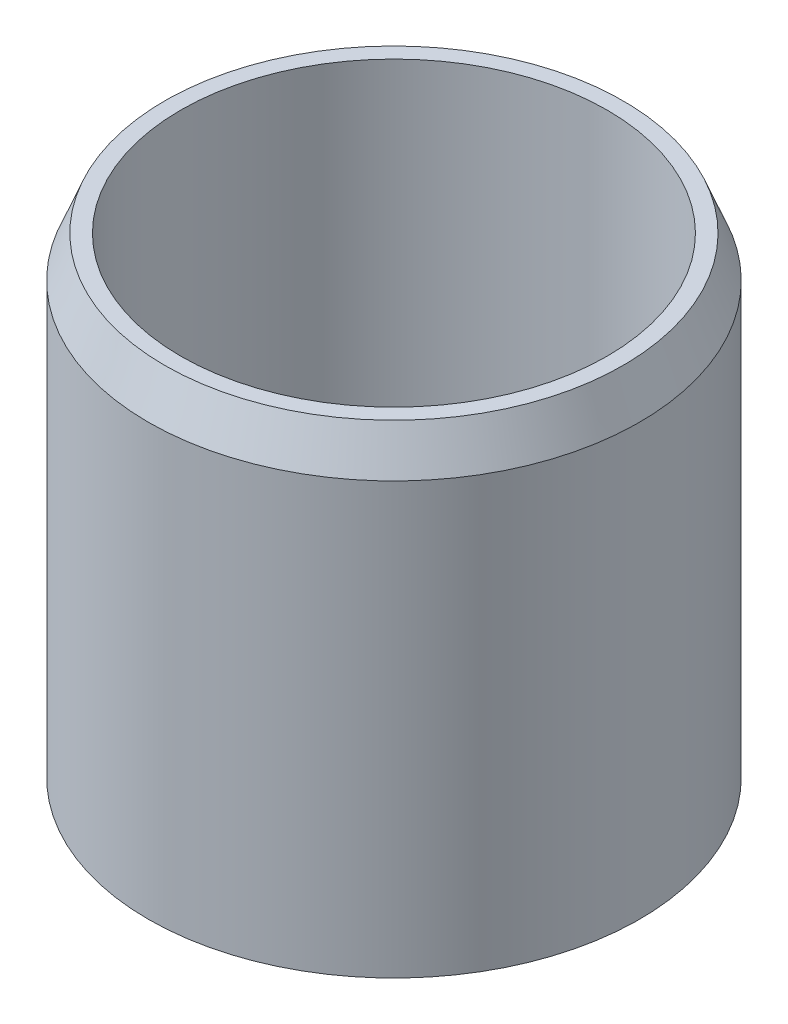
ISO-10303-21;
HEADER;
FILE_DESCRIPTION(('STEP AP214'),'2;1');
FILE_NAME('part.step','',(''),(''),'','','');
FILE_SCHEMA(('AUTOMOTIVE_DESIGN { 1 0 10303 214 1 1 1 1 }'));
ENDSEC;
DATA;
#1=APPLICATION_CONTEXT('core data for automotive mechanical design processes');
#2=APPLICATION_PROTOCOL_DEFINITION('international standard','automotive_design',2000,#1);
#3=PRODUCT_CONTEXT('',#1,'mechanical');
#4=PRODUCT('Part','Part','',(#3));
#5=PRODUCT_RELATED_PRODUCT_CATEGORY('part','',(#4));
#6=PRODUCT_DEFINITION_FORMATION('','',#4);
#7=PRODUCT_DEFINITION_CONTEXT('part definition',#1,'design');
#8=PRODUCT_DEFINITION('design','',#6,#7);
#9=PRODUCT_DEFINITION_SHAPE('','',#8);
#10=(LENGTH_UNIT() NAMED_UNIT(*) SI_UNIT(.MILLI.,.METRE.));
#11=(NAMED_UNIT(*) PLANE_ANGLE_UNIT() SI_UNIT($,.RADIAN.));
#12=(NAMED_UNIT(*) SI_UNIT($,.STERADIAN.) SOLID_ANGLE_UNIT());
#13=UNCERTAINTY_MEASURE_WITH_UNIT(LENGTH_MEASURE(1.E-05),#10,'distance_accuracy_value','');
#14=(GEOMETRIC_REPRESENTATION_CONTEXT(3) GLOBAL_UNCERTAINTY_ASSIGNED_CONTEXT((#13)) GLOBAL_UNIT_ASSIGNED_CONTEXT((#10,
#11,#12)) REPRESENTATION_CONTEXT('',''));
#15=CARTESIAN_POINT('',(0.,0.,0.));
#16=DIRECTION('',(0.,0.,1.));
#17=DIRECTION('',(1.,0.,0.));
#18=AXIS2_PLACEMENT_3D('',#15,#16,#17);
#19=CARTESIAN_POINT('',(0.,9.525,0.));
#20=DIRECTION('',(0.,1.,0.));
#21=DIRECTION('',(0.,0.,1.));
#22=AXIS2_PLACEMENT_3D('',#19,#20,#21);
#23=PLANE('',#22);
#24=CARTESIAN_POINT('',(0.,9.525,0.));
#25=DIRECTION('',(0.,1.,0.));
#26=DIRECTION('',(0.,0.,1.));
#27=AXIS2_PLACEMENT_3D('',#24,#25,#26);
#28=CIRCLE('',#27,12.7);
#29=CARTESIAN_POINT('',(0.,9.525,12.7));
#30=VERTEX_POINT('',#29);
#31=EDGE_CURVE('E104',#30,#30,#28,.T.);
#32=ORIENTED_EDGE('',*,*,#31,.F.);
#33=EDGE_LOOP('',(#32));
#34=FACE_BOUND('',#33,.T.);
#35=CARTESIAN_POINT('',(21.7411519625083,9.525,-7.06412849141284));
#36=DIRECTION('',(0.,1.,0.));
#37=DIRECTION('',(0.,0.,1.));
#38=AXIS2_PLACEMENT_3D('',#35,#36,#37);
#39=CIRCLE('',#38,7.62);
#40=CARTESIAN_POINT('',(21.7411519625083,9.525,0.555871508587157));
#41=VERTEX_POINT('',#40);
#42=EDGE_CURVE('E61',#41,#41,#39,.T.);
#43=ORIENTED_EDGE('',*,*,#42,.F.);
#44=EDGE_LOOP('',(#43));
#45=FACE_BOUND('',#44,.T.);
#46=CARTESIAN_POINT('',(13.4367708674089,9.525,18.4941284914103));
#47=DIRECTION('',(0.,1.,0.));
#48=DIRECTION('',(0.,0.,1.));
#49=AXIS2_PLACEMENT_3D('',#46,#47,#48);
#50=CIRCLE('',#49,7.62);
#51=CARTESIAN_POINT('',(13.4367708674089,9.525,26.1141284914103));
#52=VERTEX_POINT('',#51);
#53=EDGE_CURVE('E87',#52,#52,#50,.T.);
#54=ORIENTED_EDGE('',*,*,#53,.F.);
#55=EDGE_LOOP('',(#54));
#56=FACE_BOUND('',#55,.T.);
#57=CARTESIAN_POINT('',(-13.436770867403,9.525,18.4941284914123));
#58=DIRECTION('',(0.,1.,0.));
#59=DIRECTION('',(0.,0.,1.));
#60=AXIS2_PLACEMENT_3D('',#57,#58,#59);
#61=CIRCLE('',#60,7.62);
#62=CARTESIAN_POINT('',(-13.436770867403,9.525,26.1141284914122));
#63=VERTEX_POINT('',#62);
#64=EDGE_CURVE('E90',#63,#63,#61,.T.);
#65=ORIENTED_EDGE('',*,*,#64,.F.);
#66=EDGE_LOOP('',(#65));
#67=FACE_BOUND('',#66,.T.);
#68=CARTESIAN_POINT('',(-21.7411519625061,9.525,-7.06412849140975));
#69=DIRECTION('',(0.,1.,0.));
#70=DIRECTION('',(0.,0.,1.));
#71=AXIS2_PLACEMENT_3D('',#68,#69,#70);
#72=CIRCLE('',#71,7.62);
#73=CARTESIAN_POINT('',(-21.7411519625061,9.525,0.555871508590244));
#74=VERTEX_POINT('',#73);
#75=EDGE_CURVE('E93',#74,#74,#72,.T.);
#76=ORIENTED_EDGE('',*,*,#75,.F.);
#77=EDGE_LOOP('',(#76));
#78=FACE_BOUND('',#77,.T.);
#79=CARTESIAN_POINT('',(0.,9.525,-22.86));
#80=DIRECTION('',(0.,1.,0.));
#81=DIRECTION('',(0.,0.,1.));
#82=AXIS2_PLACEMENT_3D('',#79,#80,#81);
#83=CIRCLE('',#82,7.62);
#84=CARTESIAN_POINT('',(0.,9.525,-15.24));
#85=VERTEX_POINT('',#84);
#86=EDGE_CURVE('E65',#85,#85,#83,.T.);
#87=ORIENTED_EDGE('',*,*,#86,.F.);
#88=EDGE_LOOP('',(#87));
#89=FACE_BOUND('',#88,.T.);
#90=CARTESIAN_POINT('',(0.,9.525,0.));
#91=DIRECTION('',(0.,1.,0.));
#92=DIRECTION('',(0.,0.,1.));
#93=AXIS2_PLACEMENT_3D('',#90,#91,#92);
#94=CIRCLE('',#93,33.02);
#95=CARTESIAN_POINT('',(0.,9.525,33.02));
#96=VERTEX_POINT('',#95);
#97=EDGE_CURVE('E98',#96,#96,#94,.T.);
#98=ORIENTED_EDGE('',*,*,#97,.T.);
#99=EDGE_LOOP('',(#98));
#100=FACE_BOUND('',#99,.T.);
#101=ADVANCED_FACE('F41',(#34,#45,#56,#67,#78,#89,#100),#23,.T.);
#102=CARTESIAN_POINT('',(0.,9.525,0.));
#103=DIRECTION('',(0.,-1.,0.));
#104=DIRECTION('',(0.,0.,-1.));
#105=AXIS2_PLACEMENT_3D('',#102,#103,#104);
#106=CYLINDRICAL_SURFACE('',#105,38.0365);
#107=CARTESIAN_POINT('',(0.,66.6750000000001,0.));
#108=DIRECTION('',(0.,1.,0.));
#109=DIRECTION('',(0.,0.,1.));
#110=AXIS2_PLACEMENT_3D('',#107,#108,#109);
#111=CIRCLE('',#110,38.0365);
#112=CARTESIAN_POINT('',(0.,66.6750000000001,38.0365));
#113=VERTEX_POINT('',#112);
#114=EDGE_CURVE('E52',#113,#113,#111,.F.);
#115=ORIENTED_EDGE('',*,*,#114,.T.);
#116=EDGE_LOOP('',(#115));
#117=FACE_BOUND('',#116,.T.);
#118=CARTESIAN_POINT('',(0.,0.,0.));
#119=DIRECTION('',(0.,1.,0.));
#120=DIRECTION('',(0.,0.,1.));
#121=AXIS2_PLACEMENT_3D('',#118,#119,#120);
#122=CIRCLE('',#121,38.0365);
#123=CARTESIAN_POINT('',(0.,0.,38.0365));
#124=VERTEX_POINT('',#123);
#125=EDGE_CURVE('E66',#124,#124,#122,.T.);
#126=ORIENTED_EDGE('',*,*,#125,.T.);
#127=EDGE_LOOP('',(#126));
#128=FACE_BOUND('',#127,.T.);
#129=ADVANCED_FACE('F131',(#117,#128),#106,.T.);
#130=CARTESIAN_POINT('',(21.7411519625083,9.525,-7.06412849141284));
#131=DIRECTION('',(0.,-1.,0.));
#132=DIRECTION('',(0.,0.,-1.));
#133=AXIS2_PLACEMENT_3D('',#130,#131,#132);
#134=CYLINDRICAL_SURFACE('',#133,7.62);
#135=ORIENTED_EDGE('',*,*,#42,.T.);
#136=EDGE_LOOP('',(#135));
#137=FACE_BOUND('',#136,.T.);
#138=CARTESIAN_POINT('',(21.7411519625083,0.,-7.06412849141284));
#139=DIRECTION('',(0.,1.,0.));
#140=DIRECTION('',(0.,0.,1.));
#141=AXIS2_PLACEMENT_3D('',#138,#139,#140);
#142=CIRCLE('',#141,7.62);
#143=CARTESIAN_POINT('',(21.7411519625083,0.,0.555871508587157));
#144=VERTEX_POINT('',#143);
#145=EDGE_CURVE('E69',#144,#144,#142,.T.);
#146=ORIENTED_EDGE('',*,*,#145,.F.);
#147=EDGE_LOOP('',(#146));
#148=FACE_BOUND('',#147,.T.);
#149=ADVANCED_FACE('F137',(#137,#148),#134,.F.);
#150=CARTESIAN_POINT('',(13.4367708674089,9.525,18.4941284914103));
#151=DIRECTION('',(0.,-1.,0.));
#152=DIRECTION('',(0.,0.,-1.));
#153=AXIS2_PLACEMENT_3D('',#150,#151,#152);
#154=CYLINDRICAL_SURFACE('',#153,7.62);
#155=ORIENTED_EDGE('',*,*,#53,.T.);
#156=EDGE_LOOP('',(#155));
#157=FACE_BOUND('',#156,.T.);
#158=CARTESIAN_POINT('',(13.4367708674089,0.,18.4941284914103));
#159=DIRECTION('',(0.,1.,0.));
#160=DIRECTION('',(0.,0.,1.));
#161=AXIS2_PLACEMENT_3D('',#158,#159,#160);
#162=CIRCLE('',#161,7.62);
#163=CARTESIAN_POINT('',(13.4367708674089,0.,26.1141284914103));
#164=VERTEX_POINT('',#163);
#165=EDGE_CURVE('E72',#164,#164,#162,.T.);
#166=ORIENTED_EDGE('',*,*,#165,.F.);
#167=EDGE_LOOP('',(#166));
#168=FACE_BOUND('',#167,.T.);
#169=ADVANCED_FACE('F261',(#157,#168),#154,.F.);
#170=CARTESIAN_POINT('',(-13.436770867403,9.525,18.4941284914123));
#171=DIRECTION('',(0.,-1.,0.));
#172=DIRECTION('',(0.,0.,-1.));
#173=AXIS2_PLACEMENT_3D('',#170,#171,#172);
#174=CYLINDRICAL_SURFACE('',#173,7.62);
#175=ORIENTED_EDGE('',*,*,#64,.T.);
#176=EDGE_LOOP('',(#175));
#177=FACE_BOUND('',#176,.T.);
#178=CARTESIAN_POINT('',(-13.436770867403,0.,18.4941284914123));
#179=DIRECTION('',(0.,1.,0.));
#180=DIRECTION('',(0.,0.,1.));
#181=AXIS2_PLACEMENT_3D('',#178,#179,#180);
#182=CIRCLE('',#181,7.62);
#183=CARTESIAN_POINT('',(-13.436770867403,0.,26.1141284914122));
#184=VERTEX_POINT('',#183);
#185=EDGE_CURVE('E75',#184,#184,#182,.T.);
#186=ORIENTED_EDGE('',*,*,#185,.F.);
#187=EDGE_LOOP('',(#186));
#188=FACE_BOUND('',#187,.T.);
#189=ADVANCED_FACE('F250',(#177,#188),#174,.F.);
#190=CARTESIAN_POINT('',(-21.7411519625061,9.525,-7.06412849140975));
#191=DIRECTION('',(0.,-1.,0.));
#192=DIRECTION('',(0.,0.,-1.));
#193=AXIS2_PLACEMENT_3D('',#190,#191,#192);
#194=CYLINDRICAL_SURFACE('',#193,7.62);
#195=ORIENTED_EDGE('',*,*,#75,.T.);
#196=EDGE_LOOP('',(#195));
#197=FACE_BOUND('',#196,.T.);
#198=CARTESIAN_POINT('',(-21.7411519625061,0.,-7.06412849140975));
#199=DIRECTION('',(0.,1.,0.));
#200=DIRECTION('',(0.,0.,1.));
#201=AXIS2_PLACEMENT_3D('',#198,#199,#200);
#202=CIRCLE('',#201,7.62);
#203=CARTESIAN_POINT('',(-21.7411519625061,0.,0.555871508590244));
#204=VERTEX_POINT('',#203);
#205=EDGE_CURVE('E78',#204,#204,#202,.T.);
#206=ORIENTED_EDGE('',*,*,#205,.F.);
#207=EDGE_LOOP('',(#206));
#208=FACE_BOUND('',#207,.T.);
#209=ADVANCED_FACE('F125',(#197,#208),#194,.F.);
#210=CARTESIAN_POINT('',(0.,9.525,-22.86));
#211=DIRECTION('',(0.,-1.,0.));
#212=DIRECTION('',(0.,0.,-1.));
#213=AXIS2_PLACEMENT_3D('',#210,#211,#212);
#214=CYLINDRICAL_SURFACE('',#213,7.62);
#215=ORIENTED_EDGE('',*,*,#86,.T.);
#216=EDGE_LOOP('',(#215));
#217=FACE_BOUND('',#216,.T.);
#218=CARTESIAN_POINT('',(0.,0.,-22.86));
#219=DIRECTION('',(0.,1.,0.));
#220=DIRECTION('',(0.,0.,1.));
#221=AXIS2_PLACEMENT_3D('',#218,#219,#220);
#222=CIRCLE('',#221,7.62);
#223=CARTESIAN_POINT('',(0.,0.,-15.24));
#224=VERTEX_POINT('',#223);
#225=EDGE_CURVE('E81',#224,#224,#222,.T.);
#226=ORIENTED_EDGE('',*,*,#225,.F.);
#227=EDGE_LOOP('',(#226));
#228=FACE_BOUND('',#227,.T.);
#229=ADVANCED_FACE('F115',(#217,#228),#214,.F.);
#230=CARTESIAN_POINT('',(0.,9.525,0.));
#231=DIRECTION('',(0.,-1.,0.));
#232=DIRECTION('',(0.,0.,-1.));
#233=AXIS2_PLACEMENT_3D('',#230,#231,#232);
#234=CYLINDRICAL_SURFACE('',#233,6.5024);
#235=CARTESIAN_POINT('',(0.,0.,0.));
#236=DIRECTION('',(0.,1.,0.));
#237=DIRECTION('',(0.,0.,1.));
#238=AXIS2_PLACEMENT_3D('',#235,#236,#237);
#239=CIRCLE('',#238,6.5024);
#240=CARTESIAN_POINT('',(0.,0.,6.5024));
#241=VERTEX_POINT('',#240);
#242=EDGE_CURVE('E62',#241,#241,#239,.T.);
#243=ORIENTED_EDGE('',*,*,#242,.F.);
#244=EDGE_LOOP('',(#243));
#245=FACE_BOUND('',#244,.T.);
#246=CARTESIAN_POINT('',(0.,25.4,0.));
#247=DIRECTION('',(0.,1.,0.));
#248=DIRECTION('',(0.,0.,1.));
#249=AXIS2_PLACEMENT_3D('',#246,#247,#248);
#250=CIRCLE('',#249,6.5024);
#251=CARTESIAN_POINT('',(0.,25.4,6.5024));
#252=VERTEX_POINT('',#251);
#253=EDGE_CURVE('E101',#252,#252,#250,.F.);
#254=ORIENTED_EDGE('',*,*,#253,.F.);
#255=EDGE_LOOP('',(#254));
#256=FACE_BOUND('',#255,.T.);
#257=ADVANCED_FACE('F112',(#245,#256),#234,.F.);
#258=CARTESIAN_POINT('',(0.,0.,0.));
#259=DIRECTION('',(0.,1.,0.));
#260=DIRECTION('',(0.,0.,1.));
#261=AXIS2_PLACEMENT_3D('',#258,#259,#260);
#262=PLANE('',#261);
#263=ORIENTED_EDGE('',*,*,#225,.T.);
#264=EDGE_LOOP('',(#263));
#265=FACE_BOUND('',#264,.T.);
#266=ORIENTED_EDGE('',*,*,#205,.T.);
#267=EDGE_LOOP('',(#266));
#268=FACE_BOUND('',#267,.T.);
#269=ORIENTED_EDGE('',*,*,#185,.T.);
#270=EDGE_LOOP('',(#269));
#271=FACE_BOUND('',#270,.T.);
#272=ORIENTED_EDGE('',*,*,#165,.T.);
#273=EDGE_LOOP('',(#272));
#274=FACE_BOUND('',#273,.T.);
#275=ORIENTED_EDGE('',*,*,#145,.T.);
#276=EDGE_LOOP('',(#275));
#277=FACE_BOUND('',#276,.T.);
#278=ORIENTED_EDGE('',*,*,#125,.F.);
#279=EDGE_LOOP('',(#278));
#280=FACE_BOUND('',#279,.T.);
#281=ORIENTED_EDGE('',*,*,#242,.T.);
#282=EDGE_LOOP('',(#281));
#283=FACE_BOUND('',#282,.T.);
#284=ADVANCED_FACE('F114',(#265,#268,#271,#274,#277,#280,#283),#262,.F.);
#285=CARTESIAN_POINT('',(0.,73.025,0.));
#286=DIRECTION('',(0.,1.,0.));
#287=DIRECTION('',(0.,0.,1.));
#288=AXIS2_PLACEMENT_3D('',#285,#286,#287);
#289=PLANE('',#288);
#290=CARTESIAN_POINT('',(0.,73.025,0.));
#291=DIRECTION('',(0.,1.,0.));
#292=DIRECTION('',(0.,0.,1.));
#293=AXIS2_PLACEMENT_3D('',#290,#291,#292);
#294=CIRCLE('',#293,35.4965000000001);
#295=CARTESIAN_POINT('',(0.,73.025,35.4965000000001));
#296=VERTEX_POINT('',#295);
#297=EDGE_CURVE('E56',#296,#296,#294,.T.);
#298=ORIENTED_EDGE('',*,*,#297,.T.);
#299=EDGE_LOOP('',(#298));
#300=FACE_BOUND('',#299,.T.);
#301=CARTESIAN_POINT('',(0.,73.025,0.));
#302=DIRECTION('',(0.,1.,0.));
#303=DIRECTION('',(0.,0.,1.));
#304=AXIS2_PLACEMENT_3D('',#301,#302,#303);
#305=CIRCLE('',#304,33.02);
#306=CARTESIAN_POINT('',(0.,73.025,33.02));
#307=VERTEX_POINT('',#306);
#308=EDGE_CURVE('E84',#307,#307,#305,.T.);
#309=ORIENTED_EDGE('',*,*,#308,.F.);
#310=EDGE_LOOP('',(#309));
#311=FACE_BOUND('',#310,.T.);
#312=ADVANCED_FACE('F122',(#300,#311),#289,.T.);
#313=CARTESIAN_POINT('',(0.,73.025,0.));
#314=DIRECTION('',(0.,-1.,0.));
#315=DIRECTION('',(0.,0.,-1.));
#316=AXIS2_PLACEMENT_3D('',#313,#314,#315);
#317=CYLINDRICAL_SURFACE('',#316,33.02);
#318=ORIENTED_EDGE('',*,*,#308,.T.);
#319=EDGE_LOOP('',(#318));
#320=FACE_BOUND('',#319,.T.);
#321=ORIENTED_EDGE('',*,*,#97,.F.);
#322=EDGE_LOOP('',(#321));
#323=FACE_BOUND('',#322,.T.);
#324=ADVANCED_FACE('F144',(#320,#323),#317,.F.);
#325=CARTESIAN_POINT('',(0.,25.4,0.));
#326=DIRECTION('',(0.,-1.,0.));
#327=DIRECTION('',(0.,0.,-1.));
#328=AXIS2_PLACEMENT_3D('',#325,#326,#327);
#329=CYLINDRICAL_SURFACE('',#328,12.7);
#330=CARTESIAN_POINT('',(0.,29.21,0.));
#331=DIRECTION('',(0.,1.,0.));
#332=DIRECTION('',(0.,0.,1.));
#333=AXIS2_PLACEMENT_3D('',#330,#331,#332);
#334=CIRCLE('',#333,12.7);
#335=CARTESIAN_POINT('',(0.,29.21,12.7));
#336=VERTEX_POINT('',#335);
#337=EDGE_CURVE('E10',#336,#336,#334,.F.);
#338=ORIENTED_EDGE('',*,*,#337,.T.);
#339=EDGE_LOOP('',(#338));
#340=FACE_BOUND('',#339,.T.);
#341=ORIENTED_EDGE('',*,*,#31,.T.);
#342=EDGE_LOOP('',(#341));
#343=FACE_BOUND('',#342,.T.);
#344=ADVANCED_FACE('F148',(#340,#343),#329,.T.);
#345=CARTESIAN_POINT('',(0.,73.025,0.));
#346=DIRECTION('',(0.,-1.,0.));
#347=DIRECTION('',(0.,0.,-1.));
#348=AXIS2_PLACEMENT_3D('',#345,#346,#347);
#349=CONICAL_SURFACE('',#348,35.4965000000001,0.380506377112363);
#350=ORIENTED_EDGE('',*,*,#114,.F.);
#351=EDGE_LOOP('',(#350));
#352=FACE_BOUND('',#351,.T.);
#353=ORIENTED_EDGE('',*,*,#297,.F.);
#354=EDGE_LOOP('',(#353));
#355=FACE_BOUND('',#354,.T.);
#356=ADVANCED_FACE('F152',(#352,#355),#349,.T.);
#357=CARTESIAN_POINT('',(0.,25.4,0.));
#358=DIRECTION('',(0.,1.,0.));
#359=DIRECTION('',(0.,0.,1.));
#360=AXIS2_PLACEMENT_3D('',#357,#358,#359);
#361=PLANE('',#360);
#362=ORIENTED_EDGE('',*,*,#253,.T.);
#363=EDGE_LOOP('',(#362));
#364=FACE_BOUND('',#363,.T.);
#365=ADVANCED_FACE('F110',(#364),#361,.F.);
#366=CARTESIAN_POINT('',(0.,31.75,0.));
#367=DIRECTION('',(0.,1.,0.));
#368=DIRECTION('',(0.,0.,1.));
#369=AXIS2_PLACEMENT_3D('',#366,#367,#368);
#370=PLANE('',#369);
#371=CARTESIAN_POINT('',(0.,31.75,0.));
#372=DIRECTION('',(0.,1.,0.));
#373=DIRECTION('',(0.,0.,1.));
#374=AXIS2_PLACEMENT_3D('',#371,#372,#373);
#375=CIRCLE('',#374,10.16);
#376=CARTESIAN_POINT('',(0.,31.75,10.16));
#377=VERTEX_POINT('',#376);
#378=EDGE_CURVE('E48',#377,#377,#375,.T.);
#379=ORIENTED_EDGE('',*,*,#378,.T.);
#380=EDGE_LOOP('',(#379));
#381=FACE_BOUND('',#380,.T.);
#382=ADVANCED_FACE('F155',(#381),#370,.T.);
#383=CARTESIAN_POINT('',(0.,29.21,0.));
#384=DIRECTION('',(0.,1.,0.));
#385=DIRECTION('',(0.,0.,1.));
#386=AXIS2_PLACEMENT_3D('',#383,#384,#385);
#387=TOROIDAL_SURFACE('',#386,10.16,2.54);
#388=ORIENTED_EDGE('',*,*,#337,.F.);
#389=EDGE_LOOP('',(#388));
#390=FACE_BOUND('',#389,.T.);
#391=ORIENTED_EDGE('',*,*,#378,.F.);
#392=EDGE_LOOP('',(#391));
#393=FACE_BOUND('',#392,.T.);
#394=ADVANCED_FACE('F43',(#390,#393),#387,.T.);
#395=CLOSED_SHELL('',(#101,#129,#149,#169,#189,#209,#229,#257,#284,#312,#324,#344,#356,#365,
#382,#394));
#396=MANIFOLD_SOLID_BREP('B2',#395);
#397=ADVANCED_BREP_SHAPE_REPRESENTATION('',(#18,#396),#14);
#398=SHAPE_DEFINITION_REPRESENTATION(#9,#397);
ENDSEC;
END-ISO-10303-21;
